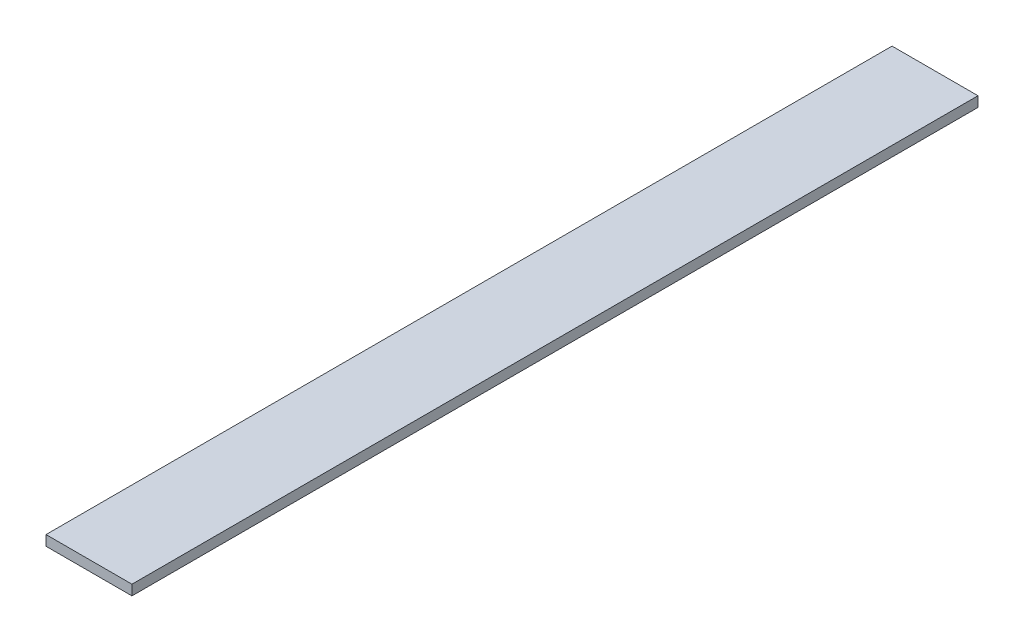
ISO-10303-21;
HEADER;
FILE_DESCRIPTION(('STEP AP214'),'2;1');
FILE_NAME('part.step','',(''),(''),'','','');
FILE_SCHEMA(('AUTOMOTIVE_DESIGN { 1 0 10303 214 1 1 1 1 }'));
ENDSEC;
DATA;
#1=APPLICATION_CONTEXT('core data for automotive mechanical design processes');
#2=APPLICATION_PROTOCOL_DEFINITION('international standard','automotive_design',2000,#1);
#3=PRODUCT_CONTEXT('',#1,'mechanical');
#4=PRODUCT('Part','Part','',(#3));
#5=PRODUCT_RELATED_PRODUCT_CATEGORY('part','',(#4));
#6=PRODUCT_DEFINITION_FORMATION('','',#4);
#7=PRODUCT_DEFINITION_CONTEXT('part definition',#1,'design');
#8=PRODUCT_DEFINITION('design','',#6,#7);
#9=PRODUCT_DEFINITION_SHAPE('','',#8);
#10=(LENGTH_UNIT() NAMED_UNIT(*) SI_UNIT(.MILLI.,.METRE.));
#11=(NAMED_UNIT(*) PLANE_ANGLE_UNIT() SI_UNIT($,.RADIAN.));
#12=(NAMED_UNIT(*) SI_UNIT($,.STERADIAN.) SOLID_ANGLE_UNIT());
#13=UNCERTAINTY_MEASURE_WITH_UNIT(LENGTH_MEASURE(1.E-05),#10,'distance_accuracy_value','');
#14=(GEOMETRIC_REPRESENTATION_CONTEXT(3) GLOBAL_UNCERTAINTY_ASSIGNED_CONTEXT((#13)) GLOBAL_UNIT_ASSIGNED_CONTEXT((#10,
#11,#12)) REPRESENTATION_CONTEXT('',''));
#15=CARTESIAN_POINT('',(0.,0.,0.));
#16=DIRECTION('',(0.,0.,1.));
#17=DIRECTION('',(1.,0.,0.));
#18=AXIS2_PLACEMENT_3D('',#15,#16,#17);
#19=CARTESIAN_POINT('',(25.4,3.,500.));
#20=DIRECTION('',(-1.,0.,0.));
#21=DIRECTION('',(0.,-1.,0.));
#22=AXIS2_PLACEMENT_3D('',#19,#20,#21);
#23=PLANE('',#22);
#24=DIRECTION('',(0.,1.,0.));
#25=VECTOR('',#24,1.);
#26=CARTESIAN_POINT('',(25.4,3.,0.));
#27=LINE('',#26,#25);
#28=CARTESIAN_POINT('',(25.4,-3.,0.));
#29=VERTEX_POINT('',#28);
#30=CARTESIAN_POINT('',(25.4,3.,0.));
#31=VERTEX_POINT('',#30);
#32=EDGE_CURVE('E100',#29,#31,#27,.T.);
#33=ORIENTED_EDGE('',*,*,#32,.T.);
#34=DIRECTION('',(0.,0.,-1.));
#35=VECTOR('',#34,1.);
#36=CARTESIAN_POINT('',(25.4,3.,500.));
#37=LINE('',#36,#35);
#38=CARTESIAN_POINT('',(25.4,3.,500.));
#39=VERTEX_POINT('',#38);
#40=EDGE_CURVE('E11',#39,#31,#37,.T.);
#41=ORIENTED_EDGE('',*,*,#40,.F.);
#42=DIRECTION('',(0.,1.,0.));
#43=VECTOR('',#42,1.);
#44=CARTESIAN_POINT('',(25.4,3.,500.));
#45=LINE('',#44,#43);
#46=CARTESIAN_POINT('',(25.4,-3.,500.));
#47=VERTEX_POINT('',#46);
#48=EDGE_CURVE('E88',#47,#39,#45,.T.);
#49=ORIENTED_EDGE('',*,*,#48,.F.);
#50=DIRECTION('',(0.,0.,-1.));
#51=VECTOR('',#50,1.);
#52=CARTESIAN_POINT('',(25.4,-3.,500.));
#53=LINE('',#52,#51);
#54=EDGE_CURVE('E96',#47,#29,#53,.T.);
#55=ORIENTED_EDGE('',*,*,#54,.T.);
#56=EDGE_LOOP('',(#33,#41,#49,#55));
#57=FACE_BOUND('',#56,.T.);
#58=ADVANCED_FACE('F37',(#57),#23,.F.);
#59=CARTESIAN_POINT('',(-25.4,3.,500.));
#60=DIRECTION('',(0.,-1.,0.));
#61=DIRECTION('',(0.,0.,-1.));
#62=AXIS2_PLACEMENT_3D('',#59,#60,#61);
#63=PLANE('',#62);
#64=DIRECTION('',(-1.,0.,0.));
#65=VECTOR('',#64,1.);
#66=CARTESIAN_POINT('',(-25.4,3.,0.));
#67=LINE('',#66,#65);
#68=CARTESIAN_POINT('',(-25.4,3.,0.));
#69=VERTEX_POINT('',#68);
#70=EDGE_CURVE('E92',#31,#69,#67,.T.);
#71=ORIENTED_EDGE('',*,*,#70,.T.);
#72=DIRECTION('',(0.,0.,-1.));
#73=VECTOR('',#72,1.);
#74=CARTESIAN_POINT('',(-25.4,3.,500.));
#75=LINE('',#74,#73);
#76=CARTESIAN_POINT('',(-25.4,3.,500.));
#77=VERTEX_POINT('',#76);
#78=EDGE_CURVE('E45',#77,#69,#75,.T.);
#79=ORIENTED_EDGE('',*,*,#78,.F.);
#80=DIRECTION('',(-1.,0.,0.));
#81=VECTOR('',#80,1.);
#82=CARTESIAN_POINT('',(-25.4,3.,500.));
#83=LINE('',#82,#81);
#84=EDGE_CURVE('E83',#39,#77,#83,.T.);
#85=ORIENTED_EDGE('',*,*,#84,.F.);
#86=ORIENTED_EDGE('',*,*,#40,.T.);
#87=EDGE_LOOP('',(#71,#79,#85,#86));
#88=FACE_BOUND('',#87,.T.);
#89=ADVANCED_FACE('F91',(#88),#63,.F.);
#90=CARTESIAN_POINT('',(-25.4,3.,500.));
#91=DIRECTION('',(1.,0.,0.));
#92=DIRECTION('',(0.,0.,-1.));
#93=AXIS2_PLACEMENT_3D('',#90,#91,#92);
#94=PLANE('',#93);
#95=DIRECTION('',(0.,-1.,0.));
#96=VECTOR('',#95,1.);
#97=CARTESIAN_POINT('',(-25.4,3.,0.));
#98=LINE('',#97,#96);
#99=CARTESIAN_POINT('',(-25.4,-3.,0.));
#100=VERTEX_POINT('',#99);
#101=EDGE_CURVE('E70',#69,#100,#98,.T.);
#102=ORIENTED_EDGE('',*,*,#101,.T.);
#103=DIRECTION('',(0.,0.,-1.));
#104=VECTOR('',#103,1.);
#105=CARTESIAN_POINT('',(-25.4,-3.,500.));
#106=LINE('',#105,#104);
#107=CARTESIAN_POINT('',(-25.4,-3.,500.));
#108=VERTEX_POINT('',#107);
#109=EDGE_CURVE('E93',#108,#100,#106,.T.);
#110=ORIENTED_EDGE('',*,*,#109,.F.);
#111=DIRECTION('',(0.,-1.,0.));
#112=VECTOR('',#111,1.);
#113=CARTESIAN_POINT('',(-25.4,3.,500.));
#114=LINE('',#113,#112);
#115=EDGE_CURVE('E86',#77,#108,#114,.T.);
#116=ORIENTED_EDGE('',*,*,#115,.F.);
#117=ORIENTED_EDGE('',*,*,#78,.T.);
#118=EDGE_LOOP('',(#102,#110,#116,#117));
#119=FACE_BOUND('',#118,.T.);
#120=ADVANCED_FACE('F94',(#119),#94,.F.);
#121=CARTESIAN_POINT('',(-25.4,-3.,500.));
#122=DIRECTION('',(0.,1.,0.));
#123=DIRECTION('',(0.,0.,1.));
#124=AXIS2_PLACEMENT_3D('',#121,#122,#123);
#125=PLANE('',#124);
#126=DIRECTION('',(1.,0.,0.));
#127=VECTOR('',#126,1.);
#128=CARTESIAN_POINT('',(-25.4,-3.,0.));
#129=LINE('',#128,#127);
#130=EDGE_CURVE('E76',#100,#29,#129,.T.);
#131=ORIENTED_EDGE('',*,*,#130,.T.);
#132=ORIENTED_EDGE('',*,*,#54,.F.);
#133=DIRECTION('',(1.,0.,0.));
#134=VECTOR('',#133,1.);
#135=CARTESIAN_POINT('',(-25.4,-3.,500.));
#136=LINE('',#135,#134);
#137=EDGE_CURVE('E53',#108,#47,#136,.T.);
#138=ORIENTED_EDGE('',*,*,#137,.F.);
#139=ORIENTED_EDGE('',*,*,#109,.T.);
#140=EDGE_LOOP('',(#131,#132,#138,#139));
#141=FACE_BOUND('',#140,.T.);
#142=ADVANCED_FACE('F107',(#141),#125,.F.);
#143=CARTESIAN_POINT('',(0.,0.,500.));
#144=DIRECTION('',(0.,0.,1.));
#145=DIRECTION('',(1.,0.,0.));
#146=AXIS2_PLACEMENT_3D('',#143,#144,#145);
#147=PLANE('',#146);
#148=ORIENTED_EDGE('',*,*,#48,.T.);
#149=ORIENTED_EDGE('',*,*,#84,.T.);
#150=ORIENTED_EDGE('',*,*,#115,.T.);
#151=ORIENTED_EDGE('',*,*,#137,.T.);
#152=EDGE_LOOP('',(#148,#149,#150,#151));
#153=FACE_BOUND('',#152,.T.);
#154=ADVANCED_FACE('F84',(#153),#147,.T.);
#155=CARTESIAN_POINT('',(0.,0.,0.));
#156=DIRECTION('',(0.,0.,1.));
#157=DIRECTION('',(1.,0.,0.));
#158=AXIS2_PLACEMENT_3D('',#155,#156,#157);
#159=PLANE('',#158);
#160=ORIENTED_EDGE('',*,*,#32,.F.);
#161=ORIENTED_EDGE('',*,*,#130,.F.);
#162=ORIENTED_EDGE('',*,*,#101,.F.);
#163=ORIENTED_EDGE('',*,*,#70,.F.);
#164=EDGE_LOOP('',(#160,#161,#162,#163));
#165=FACE_BOUND('',#164,.T.);
#166=ADVANCED_FACE('F110',(#165),#159,.F.);
#167=CLOSED_SHELL('',(#58,#89,#120,#142,#154,#166));
#168=MANIFOLD_SOLID_BREP('B2',#167);
#169=ADVANCED_BREP_SHAPE_REPRESENTATION('',(#18,#168),#14);
#170=SHAPE_DEFINITION_REPRESENTATION(#9,#169);
ENDSEC;
END-ISO-10303-21;
